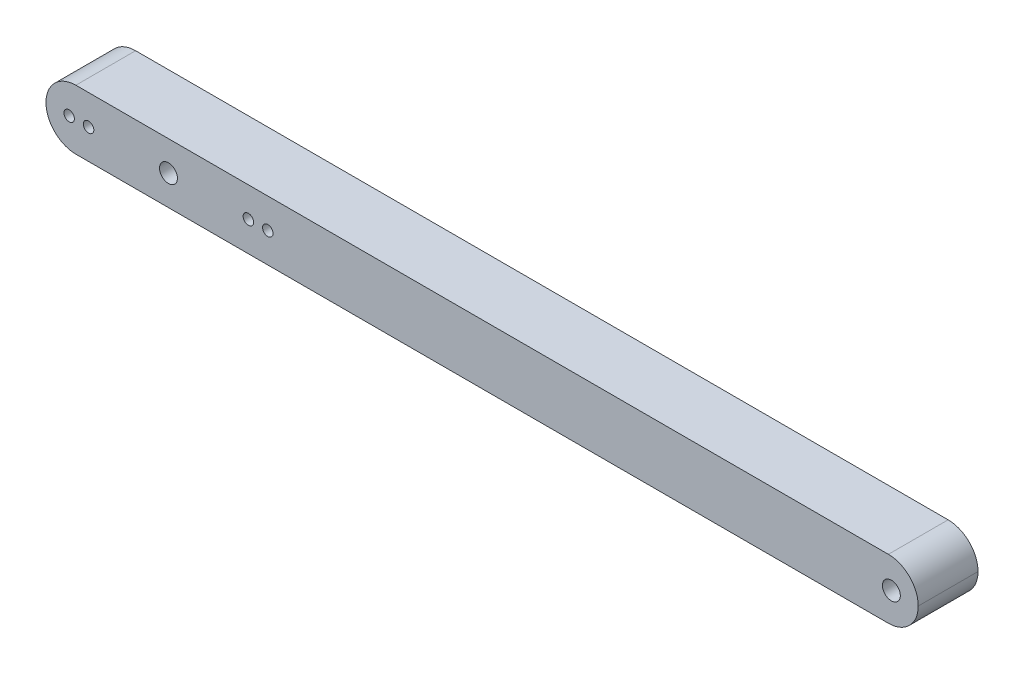
ISO-10303-21;
HEADER;
FILE_DESCRIPTION(('STEP AP214'),'2;1');
FILE_NAME('part.step','',(''),(''),'','','');
FILE_SCHEMA(('AUTOMOTIVE_DESIGN { 1 0 10303 214 1 1 1 1 }'));
ENDSEC;
DATA;
#1=APPLICATION_CONTEXT('core data for automotive mechanical design processes');
#2=APPLICATION_PROTOCOL_DEFINITION('international standard','automotive_design',2000,#1);
#3=PRODUCT_CONTEXT('',#1,'mechanical');
#4=PRODUCT('Part','Part','',(#3));
#5=PRODUCT_RELATED_PRODUCT_CATEGORY('part','',(#4));
#6=PRODUCT_DEFINITION_FORMATION('','',#4);
#7=PRODUCT_DEFINITION_CONTEXT('part definition',#1,'design');
#8=PRODUCT_DEFINITION('design','',#6,#7);
#9=PRODUCT_DEFINITION_SHAPE('','',#8);
#10=(LENGTH_UNIT() NAMED_UNIT(*) SI_UNIT(.MILLI.,.METRE.));
#11=(NAMED_UNIT(*) PLANE_ANGLE_UNIT() SI_UNIT($,.RADIAN.));
#12=(NAMED_UNIT(*) SI_UNIT($,.STERADIAN.) SOLID_ANGLE_UNIT());
#13=UNCERTAINTY_MEASURE_WITH_UNIT(LENGTH_MEASURE(1.E-05),#10,'distance_accuracy_value','');
#14=(GEOMETRIC_REPRESENTATION_CONTEXT(3) GLOBAL_UNCERTAINTY_ASSIGNED_CONTEXT((#13)) GLOBAL_UNIT_ASSIGNED_CONTEXT((#10,
#11,#12)) REPRESENTATION_CONTEXT('',''));
#15=CARTESIAN_POINT('',(0.,0.,0.));
#16=DIRECTION('',(0.,0.,1.));
#17=DIRECTION('',(1.,0.,0.));
#18=AXIS2_PLACEMENT_3D('',#15,#16,#17);
#19=CARTESIAN_POINT('',(141.,5.,10.));
#20=DIRECTION('',(0.,0.,1.));
#21=DIRECTION('',(1.,0.,0.));
#22=AXIS2_PLACEMENT_3D('',#19,#20,#21);
#23=CYLINDRICAL_SURFACE('',#22,5.);
#24=DIRECTION('',(0.,0.,1.));
#25=VECTOR('',#24,1.);
#26=CARTESIAN_POINT('',(141.,0.,10.));
#27=LINE('',#26,#25);
#28=CARTESIAN_POINT('',(141.,0.,0.));
#29=VERTEX_POINT('',#28);
#30=CARTESIAN_POINT('',(141.,0.,10.));
#31=VERTEX_POINT('',#30);
#32=EDGE_CURVE('E167',#29,#31,#27,.T.);
#33=ORIENTED_EDGE('',*,*,#32,.F.);
#34=CARTESIAN_POINT('',(141.,5.,0.));
#35=DIRECTION('',(0.,0.,1.));
#36=DIRECTION('',(1.,0.,0.));
#37=AXIS2_PLACEMENT_3D('',#34,#35,#36);
#38=CIRCLE('',#37,5.);
#39=CARTESIAN_POINT('',(146.,5.,0.));
#40=VERTEX_POINT('',#39);
#41=EDGE_CURVE('E55',#40,#29,#38,.F.);
#42=ORIENTED_EDGE('',*,*,#41,.F.);
#43=DIRECTION('',(0.,0.,-1.));
#44=VECTOR('',#43,1.);
#45=CARTESIAN_POINT('',(146.,5.,10.));
#46=LINE('',#45,#44);
#47=CARTESIAN_POINT('',(146.,5.,10.));
#48=VERTEX_POINT('',#47);
#49=EDGE_CURVE('E158',#40,#48,#46,.F.);
#50=ORIENTED_EDGE('',*,*,#49,.T.);
#51=CARTESIAN_POINT('',(141.,5.,10.));
#52=DIRECTION('',(0.,0.,1.));
#53=DIRECTION('',(1.,0.,0.));
#54=AXIS2_PLACEMENT_3D('',#51,#52,#53);
#55=CIRCLE('',#54,5.);
#56=EDGE_CURVE('E11',#31,#48,#55,.T.);
#57=ORIENTED_EDGE('',*,*,#56,.F.);
#58=EDGE_LOOP('',(#33,#42,#50,#57));
#59=FACE_BOUND('',#58,.T.);
#60=ADVANCED_FACE('F47',(#59),#23,.T.);
#61=CARTESIAN_POINT('',(141.,5.,10.));
#62=DIRECTION('',(0.,0.,1.));
#63=DIRECTION('',(1.,0.,0.));
#64=AXIS2_PLACEMENT_3D('',#61,#62,#63);
#65=CYLINDRICAL_SURFACE('',#64,5.);
#66=DIRECTION('',(0.,0.,-1.));
#67=VECTOR('',#66,1.);
#68=CARTESIAN_POINT('',(141.,10.,10.));
#69=LINE('',#68,#67);
#70=CARTESIAN_POINT('',(141.,10.,10.));
#71=VERTEX_POINT('',#70);
#72=CARTESIAN_POINT('',(141.,10.,0.));
#73=VERTEX_POINT('',#72);
#74=EDGE_CURVE('E124',#71,#73,#69,.T.);
#75=ORIENTED_EDGE('',*,*,#74,.F.);
#76=CARTESIAN_POINT('',(141.,5.,10.));
#77=DIRECTION('',(0.,0.,1.));
#78=DIRECTION('',(1.,0.,0.));
#79=AXIS2_PLACEMENT_3D('',#76,#77,#78);
#80=CIRCLE('',#79,5.);
#81=EDGE_CURVE('E161',#48,#71,#80,.T.);
#82=ORIENTED_EDGE('',*,*,#81,.F.);
#83=ORIENTED_EDGE('',*,*,#49,.F.);
#84=CARTESIAN_POINT('',(141.,5.,0.));
#85=DIRECTION('',(0.,0.,1.));
#86=DIRECTION('',(1.,0.,0.));
#87=AXIS2_PLACEMENT_3D('',#84,#85,#86);
#88=CIRCLE('',#87,5.);
#89=EDGE_CURVE('E164',#73,#40,#88,.F.);
#90=ORIENTED_EDGE('',*,*,#89,.F.);
#91=EDGE_LOOP('',(#75,#82,#83,#90));
#92=FACE_BOUND('',#91,.T.);
#93=ADVANCED_FACE('F234',(#92),#65,.T.);
#94=CARTESIAN_POINT('',(5.,5.,10.));
#95=DIRECTION('',(0.,0.,1.));
#96=DIRECTION('',(1.,0.,0.));
#97=AXIS2_PLACEMENT_3D('',#94,#95,#96);
#98=CYLINDRICAL_SURFACE('',#97,5.);
#99=DIRECTION('',(0.,0.,-1.));
#100=VECTOR('',#99,1.);
#101=CARTESIAN_POINT('',(5.,0.,10.));
#102=LINE('',#101,#100);
#103=CARTESIAN_POINT('',(5.,0.,10.));
#104=VERTEX_POINT('',#103);
#105=CARTESIAN_POINT('',(5.,0.,0.));
#106=VERTEX_POINT('',#105);
#107=EDGE_CURVE('E147',#104,#106,#102,.T.);
#108=ORIENTED_EDGE('',*,*,#107,.F.);
#109=CARTESIAN_POINT('',(5.,5.,10.));
#110=DIRECTION('',(0.,0.,1.));
#111=DIRECTION('',(1.,0.,0.));
#112=AXIS2_PLACEMENT_3D('',#109,#110,#111);
#113=CIRCLE('',#112,5.);
#114=CARTESIAN_POINT('',(0.,5.,10.));
#115=VERTEX_POINT('',#114);
#116=EDGE_CURVE('E151',#115,#104,#113,.T.);
#117=ORIENTED_EDGE('',*,*,#116,.F.);
#118=DIRECTION('',(0.,0.,1.));
#119=VECTOR('',#118,1.);
#120=CARTESIAN_POINT('',(0.,5.,10.));
#121=LINE('',#120,#119);
#122=CARTESIAN_POINT('',(0.,5.,0.));
#123=VERTEX_POINT('',#122);
#124=EDGE_CURVE('E109',#115,#123,#121,.F.);
#125=ORIENTED_EDGE('',*,*,#124,.T.);
#126=CARTESIAN_POINT('',(5.,5.,0.));
#127=DIRECTION('',(0.,0.,1.));
#128=DIRECTION('',(1.,0.,0.));
#129=AXIS2_PLACEMENT_3D('',#126,#127,#128);
#130=CIRCLE('',#129,5.);
#131=EDGE_CURVE('E103',#106,#123,#130,.F.);
#132=ORIENTED_EDGE('',*,*,#131,.F.);
#133=EDGE_LOOP('',(#108,#117,#125,#132));
#134=FACE_BOUND('',#133,.T.);
#135=ADVANCED_FACE('F238',(#134),#98,.T.);
#136=CARTESIAN_POINT('',(5.,5.,10.));
#137=DIRECTION('',(0.,0.,1.));
#138=DIRECTION('',(1.,0.,0.));
#139=AXIS2_PLACEMENT_3D('',#136,#137,#138);
#140=CYLINDRICAL_SURFACE('',#139,5.);
#141=DIRECTION('',(0.,0.,1.));
#142=VECTOR('',#141,1.);
#143=CARTESIAN_POINT('',(5.,10.,10.));
#144=LINE('',#143,#142);
#145=CARTESIAN_POINT('',(5.,10.,0.));
#146=VERTEX_POINT('',#145);
#147=CARTESIAN_POINT('',(5.,10.,10.));
#148=VERTEX_POINT('',#147);
#149=EDGE_CURVE('E112',#146,#148,#144,.T.);
#150=ORIENTED_EDGE('',*,*,#149,.F.);
#151=CARTESIAN_POINT('',(5.,5.,0.));
#152=DIRECTION('',(0.,0.,1.));
#153=DIRECTION('',(1.,0.,0.));
#154=AXIS2_PLACEMENT_3D('',#151,#152,#153);
#155=CIRCLE('',#154,5.);
#156=EDGE_CURVE('E97',#123,#146,#155,.F.);
#157=ORIENTED_EDGE('',*,*,#156,.F.);
#158=ORIENTED_EDGE('',*,*,#124,.F.);
#159=CARTESIAN_POINT('',(5.,5.,10.));
#160=DIRECTION('',(0.,0.,1.));
#161=DIRECTION('',(1.,0.,0.));
#162=AXIS2_PLACEMENT_3D('',#159,#160,#161);
#163=CIRCLE('',#162,5.);
#164=EDGE_CURVE('E108',#148,#115,#163,.T.);
#165=ORIENTED_EDGE('',*,*,#164,.F.);
#166=EDGE_LOOP('',(#150,#157,#158,#165));
#167=FACE_BOUND('',#166,.T.);
#168=ADVANCED_FACE('F113',(#167),#140,.T.);
#169=CARTESIAN_POINT('',(0.,0.,10.));
#170=DIRECTION('',(0.,1.,0.));
#171=DIRECTION('',(0.,0.,1.));
#172=AXIS2_PLACEMENT_3D('',#169,#170,#171);
#173=PLANE('',#172);
#174=DIRECTION('',(1.,0.,0.));
#175=VECTOR('',#174,1.);
#176=CARTESIAN_POINT('',(0.,0.,0.));
#177=LINE('',#176,#175);
#178=EDGE_CURVE('E127',#106,#29,#177,.T.);
#179=ORIENTED_EDGE('',*,*,#178,.T.);
#180=ORIENTED_EDGE('',*,*,#32,.T.);
#181=DIRECTION('',(1.,0.,0.));
#182=VECTOR('',#181,1.);
#183=CARTESIAN_POINT('',(0.,0.,10.));
#184=LINE('',#183,#182);
#185=EDGE_CURVE('E180',#104,#31,#184,.T.);
#186=ORIENTED_EDGE('',*,*,#185,.F.);
#187=ORIENTED_EDGE('',*,*,#107,.T.);
#188=EDGE_LOOP('',(#179,#180,#186,#187));
#189=FACE_BOUND('',#188,.T.);
#190=ADVANCED_FACE('F242',(#189),#173,.F.);
#191=CARTESIAN_POINT('',(3.875,5.,10.));
#192=DIRECTION('',(0.,0.,-1.));
#193=DIRECTION('',(-1.,0.,0.));
#194=AXIS2_PLACEMENT_3D('',#191,#192,#193);
#195=CYLINDRICAL_SURFACE('',#194,0.875);
#196=CARTESIAN_POINT('',(3.875,5.,10.));
#197=DIRECTION('',(0.,0.,1.));
#198=DIRECTION('',(1.,0.,0.));
#199=AXIS2_PLACEMENT_3D('',#196,#197,#198);
#200=CIRCLE('',#199,0.875);
#201=CARTESIAN_POINT('',(4.75,5.,10.));
#202=VERTEX_POINT('',#201);
#203=EDGE_CURVE('E173',#202,#202,#200,.T.);
#204=ORIENTED_EDGE('',*,*,#203,.T.);
#205=EDGE_LOOP('',(#204));
#206=FACE_BOUND('',#205,.T.);
#207=CARTESIAN_POINT('',(3.875,5.,0.));
#208=DIRECTION('',(0.,0.,1.));
#209=DIRECTION('',(1.,0.,0.));
#210=AXIS2_PLACEMENT_3D('',#207,#208,#209);
#211=CIRCLE('',#210,0.875);
#212=CARTESIAN_POINT('',(4.75,5.,0.));
#213=VERTEX_POINT('',#212);
#214=EDGE_CURVE('E126',#213,#213,#211,.T.);
#215=ORIENTED_EDGE('',*,*,#214,.F.);
#216=EDGE_LOOP('',(#215));
#217=FACE_BOUND('',#216,.T.);
#218=ADVANCED_FACE('F230',(#206,#217),#195,.F.);
#219=CARTESIAN_POINT('',(0.,10.,10.));
#220=DIRECTION('',(0.,1.,0.));
#221=DIRECTION('',(0.,0.,1.));
#222=AXIS2_PLACEMENT_3D('',#219,#220,#221);
#223=PLANE('',#222);
#224=DIRECTION('',(1.,0.,0.));
#225=VECTOR('',#224,1.);
#226=CARTESIAN_POINT('',(0.,10.,10.));
#227=LINE('',#226,#225);
#228=EDGE_CURVE('E177',#148,#71,#227,.T.);
#229=ORIENTED_EDGE('',*,*,#228,.T.);
#230=ORIENTED_EDGE('',*,*,#74,.T.);
#231=DIRECTION('',(1.,0.,0.));
#232=VECTOR('',#231,1.);
#233=CARTESIAN_POINT('',(0.,10.,0.));
#234=LINE('',#233,#232);
#235=EDGE_CURVE('E102',#146,#73,#234,.T.);
#236=ORIENTED_EDGE('',*,*,#235,.F.);
#237=ORIENTED_EDGE('',*,*,#149,.T.);
#238=EDGE_LOOP('',(#229,#230,#236,#237));
#239=FACE_BOUND('',#238,.T.);
#240=ADVANCED_FACE('F122',(#239),#223,.T.);
#241=CARTESIAN_POINT('',(20.5,5.,10.));
#242=DIRECTION('',(0.,0.,-1.));
#243=DIRECTION('',(-1.,0.,0.));
#244=AXIS2_PLACEMENT_3D('',#241,#242,#243);
#245=CYLINDRICAL_SURFACE('',#244,1.5);
#246=CARTESIAN_POINT('',(20.5,5.,10.));
#247=DIRECTION('',(0.,0.,1.));
#248=DIRECTION('',(1.,0.,0.));
#249=AXIS2_PLACEMENT_3D('',#246,#247,#248);
#250=CIRCLE('',#249,1.5);
#251=CARTESIAN_POINT('',(22.,5.,10.));
#252=VERTEX_POINT('',#251);
#253=EDGE_CURVE('E184',#252,#252,#250,.T.);
#254=ORIENTED_EDGE('',*,*,#253,.T.);
#255=EDGE_LOOP('',(#254));
#256=FACE_BOUND('',#255,.T.);
#257=CARTESIAN_POINT('',(20.5,5.,0.));
#258=DIRECTION('',(0.,0.,1.));
#259=DIRECTION('',(1.,0.,0.));
#260=AXIS2_PLACEMENT_3D('',#257,#258,#259);
#261=CIRCLE('',#260,1.5);
#262=CARTESIAN_POINT('',(22.,5.,0.));
#263=VERTEX_POINT('',#262);
#264=EDGE_CURVE('E135',#263,#263,#261,.T.);
#265=ORIENTED_EDGE('',*,*,#264,.F.);
#266=EDGE_LOOP('',(#265));
#267=FACE_BOUND('',#266,.T.);
#268=ADVANCED_FACE('F218',(#256,#267),#245,.F.);
#269=CARTESIAN_POINT('',(7.125,5.,10.));
#270=DIRECTION('',(0.,0.,-1.));
#271=DIRECTION('',(-1.,0.,0.));
#272=AXIS2_PLACEMENT_3D('',#269,#270,#271);
#273=CYLINDRICAL_SURFACE('',#272,0.874999999999999);
#274=CARTESIAN_POINT('',(7.125,5.,10.));
#275=DIRECTION('',(0.,0.,1.));
#276=DIRECTION('',(1.,0.,0.));
#277=AXIS2_PLACEMENT_3D('',#274,#275,#276);
#278=CIRCLE('',#277,0.874999999999999);
#279=CARTESIAN_POINT('',(8.,5.,10.));
#280=VERTEX_POINT('',#279);
#281=EDGE_CURVE('E188',#280,#280,#278,.T.);
#282=ORIENTED_EDGE('',*,*,#281,.T.);
#283=EDGE_LOOP('',(#282));
#284=FACE_BOUND('',#283,.T.);
#285=CARTESIAN_POINT('',(7.125,5.,0.));
#286=DIRECTION('',(0.,0.,1.));
#287=DIRECTION('',(1.,0.,0.));
#288=AXIS2_PLACEMENT_3D('',#285,#286,#287);
#289=CIRCLE('',#288,0.874999999999999);
#290=CARTESIAN_POINT('',(8.,5.,0.));
#291=VERTEX_POINT('',#290);
#292=EDGE_CURVE('E210',#291,#291,#289,.T.);
#293=ORIENTED_EDGE('',*,*,#292,.F.);
#294=EDGE_LOOP('',(#293));
#295=FACE_BOUND('',#294,.T.);
#296=ADVANCED_FACE('F220',(#284,#295),#273,.F.);
#297=CARTESIAN_POINT('',(37.125,5.,10.));
#298=DIRECTION('',(0.,0.,-1.));
#299=DIRECTION('',(-1.,0.,0.));
#300=AXIS2_PLACEMENT_3D('',#297,#298,#299);
#301=CYLINDRICAL_SURFACE('',#300,0.874999999999998);
#302=CARTESIAN_POINT('',(37.125,5.,10.));
#303=DIRECTION('',(0.,0.,1.));
#304=DIRECTION('',(1.,0.,0.));
#305=AXIS2_PLACEMENT_3D('',#302,#303,#304);
#306=CIRCLE('',#305,0.874999999999998);
#307=CARTESIAN_POINT('',(38.,5.,10.));
#308=VERTEX_POINT('',#307);
#309=EDGE_CURVE('E192',#308,#308,#306,.T.);
#310=ORIENTED_EDGE('',*,*,#309,.T.);
#311=EDGE_LOOP('',(#310));
#312=FACE_BOUND('',#311,.T.);
#313=CARTESIAN_POINT('',(37.125,5.,0.));
#314=DIRECTION('',(0.,0.,1.));
#315=DIRECTION('',(1.,0.,0.));
#316=AXIS2_PLACEMENT_3D('',#313,#314,#315);
#317=CIRCLE('',#316,0.874999999999998);
#318=CARTESIAN_POINT('',(38.,5.,0.));
#319=VERTEX_POINT('',#318);
#320=EDGE_CURVE('E206',#319,#319,#317,.T.);
#321=ORIENTED_EDGE('',*,*,#320,.F.);
#322=EDGE_LOOP('',(#321));
#323=FACE_BOUND('',#322,.T.);
#324=ADVANCED_FACE('F227',(#312,#323),#301,.F.);
#325=CARTESIAN_POINT('',(33.875,5.,10.));
#326=DIRECTION('',(0.,0.,-1.));
#327=DIRECTION('',(-1.,0.,0.));
#328=AXIS2_PLACEMENT_3D('',#325,#326,#327);
#329=CYLINDRICAL_SURFACE('',#328,0.874999999999998);
#330=CARTESIAN_POINT('',(33.875,5.,10.));
#331=DIRECTION('',(0.,0.,1.));
#332=DIRECTION('',(1.,0.,0.));
#333=AXIS2_PLACEMENT_3D('',#330,#331,#332);
#334=CIRCLE('',#333,0.874999999999998);
#335=CARTESIAN_POINT('',(34.75,5.,10.));
#336=VERTEX_POINT('',#335);
#337=EDGE_CURVE('E141',#336,#336,#334,.T.);
#338=ORIENTED_EDGE('',*,*,#337,.T.);
#339=EDGE_LOOP('',(#338));
#340=FACE_BOUND('',#339,.T.);
#341=CARTESIAN_POINT('',(33.875,5.,0.));
#342=DIRECTION('',(0.,0.,1.));
#343=DIRECTION('',(1.,0.,0.));
#344=AXIS2_PLACEMENT_3D('',#341,#342,#343);
#345=CIRCLE('',#344,0.874999999999998);
#346=CARTESIAN_POINT('',(34.75,5.,0.));
#347=VERTEX_POINT('',#346);
#348=EDGE_CURVE('E202',#347,#347,#345,.T.);
#349=ORIENTED_EDGE('',*,*,#348,.F.);
#350=EDGE_LOOP('',(#349));
#351=FACE_BOUND('',#350,.T.);
#352=ADVANCED_FACE('F260',(#340,#351),#329,.F.);
#353=CARTESIAN_POINT('',(141.5,5.,10.));
#354=DIRECTION('',(0.,0.,-1.));
#355=DIRECTION('',(-1.,0.,0.));
#356=AXIS2_PLACEMENT_3D('',#353,#354,#355);
#357=CYLINDRICAL_SURFACE('',#356,1.50000000000003);
#358=CARTESIAN_POINT('',(141.5,5.,10.));
#359=DIRECTION('',(0.,0.,1.));
#360=DIRECTION('',(1.,0.,0.));
#361=AXIS2_PLACEMENT_3D('',#358,#359,#360);
#362=CIRCLE('',#361,1.50000000000003);
#363=CARTESIAN_POINT('',(143.,5.,10.));
#364=VERTEX_POINT('',#363);
#365=EDGE_CURVE('E119',#364,#364,#362,.T.);
#366=ORIENTED_EDGE('',*,*,#365,.T.);
#367=EDGE_LOOP('',(#366));
#368=FACE_BOUND('',#367,.T.);
#369=CARTESIAN_POINT('',(141.5,5.,0.));
#370=DIRECTION('',(0.,0.,1.));
#371=DIRECTION('',(1.,0.,0.));
#372=AXIS2_PLACEMENT_3D('',#369,#370,#371);
#373=CIRCLE('',#372,1.50000000000003);
#374=CARTESIAN_POINT('',(143.,5.,0.));
#375=VERTEX_POINT('',#374);
#376=EDGE_CURVE('E132',#375,#375,#373,.T.);
#377=ORIENTED_EDGE('',*,*,#376,.F.);
#378=EDGE_LOOP('',(#377));
#379=FACE_BOUND('',#378,.T.);
#380=ADVANCED_FACE('F251',(#368,#379),#357,.F.);
#381=CARTESIAN_POINT('',(0.,0.,10.));
#382=DIRECTION('',(0.,0.,1.));
#383=DIRECTION('',(1.,0.,0.));
#384=AXIS2_PLACEMENT_3D('',#381,#382,#383);
#385=PLANE('',#384);
#386=ORIENTED_EDGE('',*,*,#337,.F.);
#387=EDGE_LOOP('',(#386));
#388=FACE_BOUND('',#387,.T.);
#389=ORIENTED_EDGE('',*,*,#309,.F.);
#390=EDGE_LOOP('',(#389));
#391=FACE_BOUND('',#390,.T.);
#392=ORIENTED_EDGE('',*,*,#281,.F.);
#393=EDGE_LOOP('',(#392));
#394=FACE_BOUND('',#393,.T.);
#395=ORIENTED_EDGE('',*,*,#253,.F.);
#396=EDGE_LOOP('',(#395));
#397=FACE_BOUND('',#396,.T.);
#398=ORIENTED_EDGE('',*,*,#185,.T.);
#399=ORIENTED_EDGE('',*,*,#56,.T.);
#400=ORIENTED_EDGE('',*,*,#81,.T.);
#401=ORIENTED_EDGE('',*,*,#228,.F.);
#402=ORIENTED_EDGE('',*,*,#164,.T.);
#403=ORIENTED_EDGE('',*,*,#116,.T.);
#404=EDGE_LOOP('',(#398,#399,#400,#401,#402,#403));
#405=FACE_BOUND('',#404,.T.);
#406=ORIENTED_EDGE('',*,*,#203,.F.);
#407=EDGE_LOOP('',(#406));
#408=FACE_BOUND('',#407,.T.);
#409=ORIENTED_EDGE('',*,*,#365,.F.);
#410=EDGE_LOOP('',(#409));
#411=FACE_BOUND('',#410,.T.);
#412=ADVANCED_FACE('F246',(#388,#391,#394,#397,#405,#408,#411),#385,.T.);
#413=CARTESIAN_POINT('',(0.,0.,0.));
#414=DIRECTION('',(0.,0.,1.));
#415=DIRECTION('',(1.,0.,0.));
#416=AXIS2_PLACEMENT_3D('',#413,#414,#415);
#417=PLANE('',#416);
#418=ORIENTED_EDGE('',*,*,#348,.T.);
#419=EDGE_LOOP('',(#418));
#420=FACE_BOUND('',#419,.T.);
#421=ORIENTED_EDGE('',*,*,#320,.T.);
#422=EDGE_LOOP('',(#421));
#423=FACE_BOUND('',#422,.T.);
#424=ORIENTED_EDGE('',*,*,#292,.T.);
#425=EDGE_LOOP('',(#424));
#426=FACE_BOUND('',#425,.T.);
#427=ORIENTED_EDGE('',*,*,#264,.T.);
#428=EDGE_LOOP('',(#427));
#429=FACE_BOUND('',#428,.T.);
#430=ORIENTED_EDGE('',*,*,#89,.T.);
#431=ORIENTED_EDGE('',*,*,#41,.T.);
#432=ORIENTED_EDGE('',*,*,#178,.F.);
#433=ORIENTED_EDGE('',*,*,#131,.T.);
#434=ORIENTED_EDGE('',*,*,#156,.T.);
#435=ORIENTED_EDGE('',*,*,#235,.T.);
#436=EDGE_LOOP('',(#430,#431,#432,#433,#434,#435));
#437=FACE_BOUND('',#436,.T.);
#438=ORIENTED_EDGE('',*,*,#214,.T.);
#439=EDGE_LOOP('',(#438));
#440=FACE_BOUND('',#439,.T.);
#441=ORIENTED_EDGE('',*,*,#376,.T.);
#442=EDGE_LOOP('',(#441));
#443=FACE_BOUND('',#442,.T.);
#444=ADVANCED_FACE('F99',(#420,#423,#426,#429,#437,#440,#443),#417,.F.);
#445=CLOSED_SHELL('',(#60,#93,#135,#168,#190,#218,#240,#268,#296,#324,#352,#380,#412,#444));
#446=MANIFOLD_SOLID_BREP('B2',#445);
#447=ADVANCED_BREP_SHAPE_REPRESENTATION('',(#18,#446),#14);
#448=SHAPE_DEFINITION_REPRESENTATION(#9,#447);
ENDSEC;
END-ISO-10303-21;
